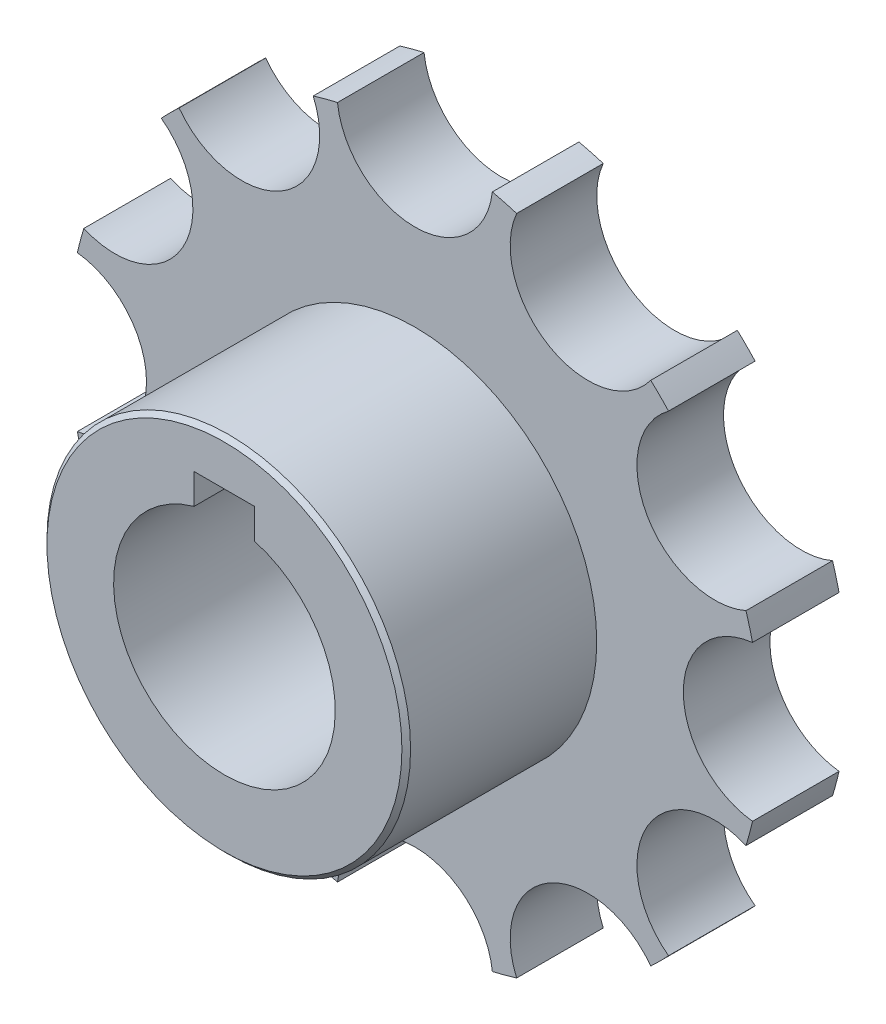
ISO-10303-21;
HEADER;
FILE_DESCRIPTION(('STEP AP214'),'2;1');
FILE_NAME('part.step','',(''),(''),'','','');
FILE_SCHEMA(('AUTOMOTIVE_DESIGN { 1 0 10303 214 1 1 1 1 }'));
ENDSEC;
DATA;
#1=APPLICATION_CONTEXT('core data for automotive mechanical design processes');
#2=APPLICATION_PROTOCOL_DEFINITION('international standard','automotive_design',2000,#1);
#3=PRODUCT_CONTEXT('',#1,'mechanical');
#4=PRODUCT('Part','Part','',(#3));
#5=PRODUCT_RELATED_PRODUCT_CATEGORY('part','',(#4));
#6=PRODUCT_DEFINITION_FORMATION('','',#4);
#7=PRODUCT_DEFINITION_CONTEXT('part definition',#1,'design');
#8=PRODUCT_DEFINITION('design','',#6,#7);
#9=PRODUCT_DEFINITION_SHAPE('','',#8);
#10=(LENGTH_UNIT() NAMED_UNIT(*) SI_UNIT(.MILLI.,.METRE.));
#11=(NAMED_UNIT(*) PLANE_ANGLE_UNIT() SI_UNIT($,.RADIAN.));
#12=(NAMED_UNIT(*) SI_UNIT($,.STERADIAN.) SOLID_ANGLE_UNIT());
#13=UNCERTAINTY_MEASURE_WITH_UNIT(LENGTH_MEASURE(1.E-05),#10,'distance_accuracy_value','');
#14=(GEOMETRIC_REPRESENTATION_CONTEXT(3) GLOBAL_UNCERTAINTY_ASSIGNED_CONTEXT((#13)) GLOBAL_UNIT_ASSIGNED_CONTEXT((#10,
#11,#12)) REPRESENTATION_CONTEXT('',''));
#15=CARTESIAN_POINT('',(0.,0.,0.));
#16=DIRECTION('',(0.,0.,1.));
#17=DIRECTION('',(1.,0.,0.));
#18=AXIS2_PLACEMENT_3D('',#15,#16,#17);
#19=CARTESIAN_POINT('',(-19.9999999999996,34.6410161513778,10.));
#20=DIRECTION('',(0.,0.,-1.));
#21=DIRECTION('',(-1.,0.,0.));
#22=AXIS2_PLACEMENT_3D('',#19,#20,#21);
#23=CYLINDRICAL_SURFACE('',#22,8.99999999999999);
#24=CARTESIAN_POINT('',(-19.9999999999996,34.6410161513778,0.));
#25=DIRECTION('',(0.,0.,1.));
#26=DIRECTION('',(1.,0.,0.));
#27=AXIS2_PLACEMENT_3D('',#24,#25,#26);
#28=CIRCLE('',#27,8.99999999999999);
#29=CARTESIAN_POINT('',(-27.2384987249422,29.2927326688945,0.));
#30=VERTEX_POINT('',#29);
#31=CARTESIAN_POINT('',(-11.7490012750569,38.2355981911976,0.));
#32=VERTEX_POINT('',#31);
#33=EDGE_CURVE('E279',#30,#32,#28,.T.);
#34=ORIENTED_EDGE('',*,*,#33,.F.);
#35=DIRECTION('',(0.,0.,-1.));
#36=VECTOR('',#35,1.);
#37=CARTESIAN_POINT('',(-27.2384987249422,29.2927326688945,10.));
#38=LINE('',#37,#36);
#39=CARTESIAN_POINT('',(-27.2384987249422,29.2927326688945,10.));
#40=VERTEX_POINT('',#39);
#41=EDGE_CURVE('E165',#40,#30,#38,.T.);
#42=ORIENTED_EDGE('',*,*,#41,.F.);
#43=CARTESIAN_POINT('',(-19.9999999999996,34.6410161513778,10.));
#44=DIRECTION('',(0.,0.,1.));
#45=DIRECTION('',(1.,0.,0.));
#46=AXIS2_PLACEMENT_3D('',#43,#44,#45);
#47=CIRCLE('',#46,8.99999999999999);
#48=CARTESIAN_POINT('',(-11.7490012750569,38.2355981911976,10.));
#49=VERTEX_POINT('',#48);
#50=EDGE_CURVE('E496',#40,#49,#47,.T.);
#51=ORIENTED_EDGE('',*,*,#50,.T.);
#52=DIRECTION('',(0.,0.,-1.));
#53=VECTOR('',#52,1.);
#54=CARTESIAN_POINT('',(-11.7490012750569,38.2355981911976,10.));
#55=LINE('',#54,#53);
#56=EDGE_CURVE('E160',#49,#32,#55,.T.);
#57=ORIENTED_EDGE('',*,*,#56,.T.);
#58=EDGE_LOOP('',(#34,#42,#51,#57));
#59=FACE_BOUND('',#58,.T.);
#60=ADVANCED_FACE('F41',(#59),#23,.F.);
#61=CARTESIAN_POINT('',(0.,0.,10.));
#62=DIRECTION('',(0.,0.,-1.));
#63=DIRECTION('',(-1.,0.,0.));
#64=AXIS2_PLACEMENT_3D('',#61,#62,#63);
#65=CYLINDRICAL_SURFACE('',#64,40.);
#66=CARTESIAN_POINT('',(0.,0.,0.));
#67=DIRECTION('',(0.,0.,1.));
#68=DIRECTION('',(1.,0.,0.));
#69=AXIS2_PLACEMENT_3D('',#66,#67,#68);
#70=CIRCLE('',#69,40.);
#71=CARTESIAN_POINT('',(-29.2927326688938,27.238498724943,0.));
#72=VERTEX_POINT('',#71);
#73=EDGE_CURVE('E283',#30,#72,#70,.T.);
#74=ORIENTED_EDGE('',*,*,#73,.T.);
#75=DIRECTION('',(0.,0.,-1.));
#76=VECTOR('',#75,1.);
#77=CARTESIAN_POINT('',(-29.2927326688938,27.238498724943,10.));
#78=LINE('',#77,#76);
#79=CARTESIAN_POINT('',(-29.2927326688938,27.238498724943,10.));
#80=VERTEX_POINT('',#79);
#81=EDGE_CURVE('E400',#80,#72,#78,.T.);
#82=ORIENTED_EDGE('',*,*,#81,.F.);
#83=CARTESIAN_POINT('',(0.,0.,10.));
#84=DIRECTION('',(0.,0.,1.));
#85=DIRECTION('',(1.,0.,0.));
#86=AXIS2_PLACEMENT_3D('',#83,#84,#85);
#87=CIRCLE('',#86,40.);
#88=EDGE_CURVE('E259',#40,#80,#87,.T.);
#89=ORIENTED_EDGE('',*,*,#88,.F.);
#90=ORIENTED_EDGE('',*,*,#41,.T.);
#91=EDGE_LOOP('',(#74,#82,#89,#90));
#92=FACE_BOUND('',#91,.T.);
#93=ADVANCED_FACE('F432',(#92),#65,.T.);
#94=CARTESIAN_POINT('',(-34.6410161513773,20.0000000000004,10.));
#95=DIRECTION('',(0.,0.,-1.));
#96=DIRECTION('',(-1.,0.,0.));
#97=AXIS2_PLACEMENT_3D('',#94,#95,#96);
#98=CYLINDRICAL_SURFACE('',#97,9.);
#99=CARTESIAN_POINT('',(-34.6410161513773,20.0000000000004,0.));
#100=DIRECTION('',(0.,0.,1.));
#101=DIRECTION('',(1.,0.,0.));
#102=AXIS2_PLACEMENT_3D('',#99,#100,#101);
#103=CIRCLE('',#102,9.);
#104=CARTESIAN_POINT('',(-38.2355981911973,11.7490012750578,0.));
#105=VERTEX_POINT('',#104);
#106=EDGE_CURVE('E287',#105,#72,#103,.T.);
#107=ORIENTED_EDGE('',*,*,#106,.F.);
#108=DIRECTION('',(0.,0.,-1.));
#109=VECTOR('',#108,1.);
#110=CARTESIAN_POINT('',(-38.2355981911973,11.7490012750578,10.));
#111=LINE('',#110,#109);
#112=CARTESIAN_POINT('',(-38.2355981911973,11.7490012750578,10.));
#113=VERTEX_POINT('',#112);
#114=EDGE_CURVE('E397',#113,#105,#111,.T.);
#115=ORIENTED_EDGE('',*,*,#114,.F.);
#116=CARTESIAN_POINT('',(-34.6410161513773,20.0000000000004,10.));
#117=DIRECTION('',(0.,0.,1.));
#118=DIRECTION('',(1.,0.,0.));
#119=AXIS2_PLACEMENT_3D('',#116,#117,#118);
#120=CIRCLE('',#119,9.);
#121=EDGE_CURVE('E500',#113,#80,#120,.T.);
#122=ORIENTED_EDGE('',*,*,#121,.T.);
#123=ORIENTED_EDGE('',*,*,#81,.T.);
#124=EDGE_LOOP('',(#107,#115,#122,#123));
#125=FACE_BOUND('',#124,.T.);
#126=ADVANCED_FACE('F437',(#125),#98,.F.);
#127=CARTESIAN_POINT('',(-38.9874999999999,8.94286552230365,0.));
#128=VERTEX_POINT('',#127);
#129=EDGE_CURVE('E289',#105,#128,#70,.T.);
#130=ORIENTED_EDGE('',*,*,#129,.T.);
#131=DIRECTION('',(0.,0.,-1.));
#132=VECTOR('',#131,1.);
#133=CARTESIAN_POINT('',(-38.9874999999999,8.94286552230365,10.));
#134=LINE('',#133,#132);
#135=CARTESIAN_POINT('',(-38.9874999999999,8.94286552230365,10.));
#136=VERTEX_POINT('',#135);
#137=EDGE_CURVE('E394',#136,#128,#134,.T.);
#138=ORIENTED_EDGE('',*,*,#137,.F.);
#139=EDGE_CURVE('E501',#113,#136,#87,.T.);
#140=ORIENTED_EDGE('',*,*,#139,.F.);
#141=ORIENTED_EDGE('',*,*,#114,.T.);
#142=EDGE_LOOP('',(#130,#138,#140,#141));
#143=FACE_BOUND('',#142,.T.);
#144=ADVANCED_FACE('F440',(#143),#65,.T.);
#145=CARTESIAN_POINT('',(-40.,4.18977760661176E-13,10.));
#146=DIRECTION('',(0.,0.,-1.));
#147=DIRECTION('',(-1.,0.,0.));
#148=AXIS2_PLACEMENT_3D('',#145,#146,#147);
#149=CYLINDRICAL_SURFACE('',#148,9.);
#150=CARTESIAN_POINT('',(-40.,4.18977760661176E-13,0.));
#151=DIRECTION('',(0.,0.,1.));
#152=DIRECTION('',(1.,0.,0.));
#153=AXIS2_PLACEMENT_3D('',#150,#151,#152);
#154=CIRCLE('',#153,9.);
#155=CARTESIAN_POINT('',(-38.9875000000001,-8.94286552230283,0.));
#156=VERTEX_POINT('',#155);
#157=EDGE_CURVE('E293',#156,#128,#154,.T.);
#158=ORIENTED_EDGE('',*,*,#157,.F.);
#159=DIRECTION('',(0.,0.,-1.));
#160=VECTOR('',#159,1.);
#161=CARTESIAN_POINT('',(-38.9875000000001,-8.94286552230283,10.));
#162=LINE('',#161,#160);
#163=CARTESIAN_POINT('',(-38.9875000000001,-8.94286552230283,10.));
#164=VERTEX_POINT('',#163);
#165=EDGE_CURVE('E391',#164,#156,#162,.T.);
#166=ORIENTED_EDGE('',*,*,#165,.F.);
#167=CARTESIAN_POINT('',(-40.,4.18977760661176E-13,10.));
#168=DIRECTION('',(0.,0.,1.));
#169=DIRECTION('',(1.,0.,0.));
#170=AXIS2_PLACEMENT_3D('',#167,#168,#169);
#171=CIRCLE('',#170,9.);
#172=EDGE_CURVE('E505',#164,#136,#171,.T.);
#173=ORIENTED_EDGE('',*,*,#172,.T.);
#174=ORIENTED_EDGE('',*,*,#137,.T.);
#175=EDGE_LOOP('',(#158,#166,#173,#174));
#176=FACE_BOUND('',#175,.T.);
#177=ADVANCED_FACE('F582',(#176),#149,.F.);
#178=CARTESIAN_POINT('',(-38.2355981911975,-11.7490012750571,0.));
#179=VERTEX_POINT('',#178);
#180=EDGE_CURVE('E297',#156,#179,#70,.T.);
#181=ORIENTED_EDGE('',*,*,#180,.T.);
#182=DIRECTION('',(0.,0.,-1.));
#183=VECTOR('',#182,1.);
#184=CARTESIAN_POINT('',(-38.2355981911975,-11.7490012750571,10.));
#185=LINE('',#184,#183);
#186=CARTESIAN_POINT('',(-38.2355981911975,-11.7490012750571,10.));
#187=VERTEX_POINT('',#186);
#188=EDGE_CURVE('E388',#187,#179,#185,.T.);
#189=ORIENTED_EDGE('',*,*,#188,.F.);
#190=EDGE_CURVE('E509',#164,#187,#87,.T.);
#191=ORIENTED_EDGE('',*,*,#190,.F.);
#192=ORIENTED_EDGE('',*,*,#165,.T.);
#193=EDGE_LOOP('',(#181,#189,#191,#192));
#194=FACE_BOUND('',#193,.T.);
#195=ADVANCED_FACE('F586',(#194),#65,.T.);
#196=CARTESIAN_POINT('',(-34.6410161513777,-19.9999999999997,10.));
#197=DIRECTION('',(0.,0.,-1.));
#198=DIRECTION('',(-1.,0.,0.));
#199=AXIS2_PLACEMENT_3D('',#196,#197,#198);
#200=CYLINDRICAL_SURFACE('',#199,8.99999999999999);
#201=CARTESIAN_POINT('',(-34.6410161513777,-19.9999999999997,0.));
#202=DIRECTION('',(0.,0.,1.));
#203=DIRECTION('',(1.,0.,0.));
#204=AXIS2_PLACEMENT_3D('',#201,#202,#203);
#205=CIRCLE('',#204,8.99999999999999);
#206=CARTESIAN_POINT('',(-29.2927326688944,-27.2384987249423,0.));
#207=VERTEX_POINT('',#206);
#208=EDGE_CURVE('E298',#207,#179,#205,.T.);
#209=ORIENTED_EDGE('',*,*,#208,.F.);
#210=DIRECTION('',(0.,0.,-1.));
#211=VECTOR('',#210,1.);
#212=CARTESIAN_POINT('',(-29.2927326688944,-27.2384987249423,10.));
#213=LINE('',#212,#211);
#214=CARTESIAN_POINT('',(-29.2927326688944,-27.2384987249423,10.));
#215=VERTEX_POINT('',#214);
#216=EDGE_CURVE('E385',#215,#207,#213,.T.);
#217=ORIENTED_EDGE('',*,*,#216,.F.);
#218=CARTESIAN_POINT('',(-34.6410161513777,-19.9999999999997,10.));
#219=DIRECTION('',(0.,0.,1.));
#220=DIRECTION('',(1.,0.,0.));
#221=AXIS2_PLACEMENT_3D('',#218,#219,#220);
#222=CIRCLE('',#221,8.99999999999999);
#223=EDGE_CURVE('E510',#215,#187,#222,.T.);
#224=ORIENTED_EDGE('',*,*,#223,.T.);
#225=ORIENTED_EDGE('',*,*,#188,.T.);
#226=EDGE_LOOP('',(#209,#217,#224,#225));
#227=FACE_BOUND('',#226,.T.);
#228=ADVANCED_FACE('F589',(#227),#200,.F.);
#229=CARTESIAN_POINT('',(-27.2384987249429,-29.2927326688939,0.));
#230=VERTEX_POINT('',#229);
#231=EDGE_CURVE('E302',#207,#230,#70,.T.);
#232=ORIENTED_EDGE('',*,*,#231,.T.);
#233=DIRECTION('',(0.,0.,-1.));
#234=VECTOR('',#233,1.);
#235=CARTESIAN_POINT('',(-27.2384987249429,-29.2927326688939,10.));
#236=LINE('',#235,#234);
#237=CARTESIAN_POINT('',(-27.2384987249429,-29.2927326688939,10.));
#238=VERTEX_POINT('',#237);
#239=EDGE_CURVE('E382',#238,#230,#236,.T.);
#240=ORIENTED_EDGE('',*,*,#239,.F.);
#241=EDGE_CURVE('E514',#215,#238,#87,.T.);
#242=ORIENTED_EDGE('',*,*,#241,.F.);
#243=ORIENTED_EDGE('',*,*,#216,.T.);
#244=EDGE_LOOP('',(#232,#240,#242,#243));
#245=FACE_BOUND('',#244,.T.);
#246=ADVANCED_FACE('F593',(#245),#65,.T.);
#247=CARTESIAN_POINT('',(-19.9999999999989,-34.6410161513778,10.));
#248=DIRECTION('',(0.,0.,-1.));
#249=DIRECTION('',(-1.,0.,0.));
#250=AXIS2_PLACEMENT_3D('',#247,#248,#249);
#251=CYLINDRICAL_SURFACE('',#250,9.00000000000139);
#252=CARTESIAN_POINT('',(-19.9999999999989,-34.6410161513778,0.));
#253=DIRECTION('',(0.,0.,1.));
#254=DIRECTION('',(1.,0.,0.));
#255=AXIS2_PLACEMENT_3D('',#252,#253,#254);
#256=CIRCLE('',#255,9.00000000000139);
#257=CARTESIAN_POINT('',(-11.749001275055,-38.2355981911981,0.));
#258=VERTEX_POINT('',#257);
#259=EDGE_CURVE('E303',#258,#230,#256,.T.);
#260=ORIENTED_EDGE('',*,*,#259,.F.);
#261=DIRECTION('',(0.,0.,-1.));
#262=VECTOR('',#261,1.);
#263=CARTESIAN_POINT('',(-11.749001275055,-38.2355981911981,10.));
#264=LINE('',#263,#262);
#265=CARTESIAN_POINT('',(-11.749001275055,-38.2355981911981,10.));
#266=VERTEX_POINT('',#265);
#267=EDGE_CURVE('E379',#266,#258,#264,.T.);
#268=ORIENTED_EDGE('',*,*,#267,.F.);
#269=CARTESIAN_POINT('',(-19.9999999999989,-34.6410161513778,10.));
#270=DIRECTION('',(0.,0.,1.));
#271=DIRECTION('',(1.,0.,0.));
#272=AXIS2_PLACEMENT_3D('',#269,#270,#271);
#273=CIRCLE('',#272,9.00000000000139);
#274=EDGE_CURVE('E515',#266,#238,#273,.T.);
#275=ORIENTED_EDGE('',*,*,#274,.T.);
#276=ORIENTED_EDGE('',*,*,#239,.T.);
#277=EDGE_LOOP('',(#260,#268,#275,#276));
#278=FACE_BOUND('',#277,.T.);
#279=ADVANCED_FACE('F596',(#278),#251,.F.);
#280=CARTESIAN_POINT('',(-8.94286552230344,-38.9875,0.));
#281=VERTEX_POINT('',#280);
#282=EDGE_CURVE('E307',#258,#281,#70,.T.);
#283=ORIENTED_EDGE('',*,*,#282,.T.);
#284=DIRECTION('',(0.,0.,-1.));
#285=VECTOR('',#284,1.);
#286=CARTESIAN_POINT('',(-8.94286552230344,-38.9875,10.));
#287=LINE('',#286,#285);
#288=CARTESIAN_POINT('',(-8.94286552230344,-38.9875,10.));
#289=VERTEX_POINT('',#288);
#290=EDGE_CURVE('E376',#289,#281,#287,.T.);
#291=ORIENTED_EDGE('',*,*,#290,.F.);
#292=EDGE_CURVE('E519',#266,#289,#87,.T.);
#293=ORIENTED_EDGE('',*,*,#292,.F.);
#294=ORIENTED_EDGE('',*,*,#267,.T.);
#295=EDGE_LOOP('',(#283,#291,#293,#294));
#296=FACE_BOUND('',#295,.T.);
#297=ADVANCED_FACE('F600',(#296),#65,.T.);
#298=CARTESIAN_POINT('',(1.12217261562639E-12,-40.,10.));
#299=DIRECTION('',(0.,0.,-1.));
#300=DIRECTION('',(-1.,0.,0.));
#301=AXIS2_PLACEMENT_3D('',#298,#299,#300);
#302=CYLINDRICAL_SURFACE('',#301,9.00000000000134);
#303=CARTESIAN_POINT('',(1.12217261562639E-12,-40.,0.));
#304=DIRECTION('',(0.,0.,1.));
#305=DIRECTION('',(1.,0.,0.));
#306=AXIS2_PLACEMENT_3D('',#303,#304,#305);
#307=CIRCLE('',#306,9.00000000000134);
#308=CARTESIAN_POINT('',(8.94286552230563,-38.9874999999995,0.));
#309=VERTEX_POINT('',#308);
#310=EDGE_CURVE('E308',#309,#281,#307,.T.);
#311=ORIENTED_EDGE('',*,*,#310,.F.);
#312=DIRECTION('',(0.,0.,-1.));
#313=VECTOR('',#312,1.);
#314=CARTESIAN_POINT('',(8.94286552230563,-38.9874999999995,10.));
#315=LINE('',#314,#313);
#316=CARTESIAN_POINT('',(8.94286552230563,-38.9874999999995,10.));
#317=VERTEX_POINT('',#316);
#318=EDGE_CURVE('E373',#317,#309,#315,.T.);
#319=ORIENTED_EDGE('',*,*,#318,.F.);
#320=CARTESIAN_POINT('',(1.12217261562639E-12,-40.,10.));
#321=DIRECTION('',(0.,0.,1.));
#322=DIRECTION('',(1.,0.,0.));
#323=AXIS2_PLACEMENT_3D('',#320,#321,#322);
#324=CIRCLE('',#323,9.00000000000134);
#325=EDGE_CURVE('E520',#317,#289,#324,.T.);
#326=ORIENTED_EDGE('',*,*,#325,.T.);
#327=ORIENTED_EDGE('',*,*,#290,.T.);
#328=EDGE_LOOP('',(#311,#319,#326,#327));
#329=FACE_BOUND('',#328,.T.);
#330=ADVANCED_FACE('F603',(#329),#302,.F.);
#331=CARTESIAN_POINT('',(11.7490012750572,-38.2355981911975,0.));
#332=VERTEX_POINT('',#331);
#333=EDGE_CURVE('E312',#309,#332,#70,.T.);
#334=ORIENTED_EDGE('',*,*,#333,.T.);
#335=DIRECTION('',(0.,0.,-1.));
#336=VECTOR('',#335,1.);
#337=CARTESIAN_POINT('',(11.7490012750572,-38.2355981911975,10.));
#338=LINE('',#337,#336);
#339=CARTESIAN_POINT('',(11.7490012750572,-38.2355981911975,10.));
#340=VERTEX_POINT('',#339);
#341=EDGE_CURVE('E370',#340,#332,#338,.T.);
#342=ORIENTED_EDGE('',*,*,#341,.F.);
#343=EDGE_CURVE('E524',#317,#340,#87,.T.);
#344=ORIENTED_EDGE('',*,*,#343,.F.);
#345=ORIENTED_EDGE('',*,*,#318,.T.);
#346=EDGE_LOOP('',(#334,#342,#344,#345));
#347=FACE_BOUND('',#346,.T.);
#348=ADVANCED_FACE('F607',(#347),#65,.T.);
#349=CARTESIAN_POINT('',(19.9999999999998,-34.6410161513777,10.));
#350=DIRECTION('',(0.,0.,-1.));
#351=DIRECTION('',(-1.,0.,0.));
#352=AXIS2_PLACEMENT_3D('',#349,#350,#351);
#353=CYLINDRICAL_SURFACE('',#352,9.);
#354=CARTESIAN_POINT('',(19.9999999999998,-34.6410161513777,0.));
#355=DIRECTION('',(0.,0.,1.));
#356=DIRECTION('',(1.,0.,0.));
#357=AXIS2_PLACEMENT_3D('',#354,#355,#356);
#358=CIRCLE('',#357,9.);
#359=CARTESIAN_POINT('',(27.2384987249424,-29.2927326688943,0.));
#360=VERTEX_POINT('',#359);
#361=EDGE_CURVE('E313',#360,#332,#358,.T.);
#362=ORIENTED_EDGE('',*,*,#361,.F.);
#363=DIRECTION('',(0.,0.,-1.));
#364=VECTOR('',#363,1.);
#365=CARTESIAN_POINT('',(27.2384987249424,-29.2927326688943,10.));
#366=LINE('',#365,#364);
#367=CARTESIAN_POINT('',(27.2384987249424,-29.2927326688943,10.));
#368=VERTEX_POINT('',#367);
#369=EDGE_CURVE('E367',#368,#360,#366,.T.);
#370=ORIENTED_EDGE('',*,*,#369,.F.);
#371=CARTESIAN_POINT('',(19.9999999999998,-34.6410161513777,10.));
#372=DIRECTION('',(0.,0.,1.));
#373=DIRECTION('',(1.,0.,0.));
#374=AXIS2_PLACEMENT_3D('',#371,#372,#373);
#375=CIRCLE('',#374,9.);
#376=EDGE_CURVE('E525',#368,#340,#375,.T.);
#377=ORIENTED_EDGE('',*,*,#376,.T.);
#378=ORIENTED_EDGE('',*,*,#341,.T.);
#379=EDGE_LOOP('',(#362,#370,#377,#378));
#380=FACE_BOUND('',#379,.T.);
#381=ADVANCED_FACE('F610',(#380),#353,.F.);
#382=CARTESIAN_POINT('',(29.292732668894,-27.2384987249428,0.));
#383=VERTEX_POINT('',#382);
#384=EDGE_CURVE('E317',#360,#383,#70,.T.);
#385=ORIENTED_EDGE('',*,*,#384,.T.);
#386=DIRECTION('',(0.,0.,-1.));
#387=VECTOR('',#386,1.);
#388=CARTESIAN_POINT('',(29.292732668894,-27.2384987249428,10.));
#389=LINE('',#388,#387);
#390=CARTESIAN_POINT('',(29.292732668894,-27.2384987249428,10.));
#391=VERTEX_POINT('',#390);
#392=EDGE_CURVE('E364',#391,#383,#389,.T.);
#393=ORIENTED_EDGE('',*,*,#392,.F.);
#394=EDGE_CURVE('E529',#368,#391,#87,.T.);
#395=ORIENTED_EDGE('',*,*,#394,.F.);
#396=ORIENTED_EDGE('',*,*,#369,.T.);
#397=EDGE_LOOP('',(#385,#393,#395,#396));
#398=FACE_BOUND('',#397,.T.);
#399=ADVANCED_FACE('F614',(#398),#65,.T.);
#400=CARTESIAN_POINT('',(34.6410161513775,-20.0000000000002,10.));
#401=DIRECTION('',(0.,0.,-1.));
#402=DIRECTION('',(-1.,0.,0.));
#403=AXIS2_PLACEMENT_3D('',#400,#401,#402);
#404=CYLINDRICAL_SURFACE('',#403,9.);
#405=CARTESIAN_POINT('',(34.6410161513775,-20.0000000000002,0.));
#406=DIRECTION('',(0.,0.,1.));
#407=DIRECTION('',(1.,0.,0.));
#408=AXIS2_PLACEMENT_3D('',#405,#406,#407);
#409=CIRCLE('',#408,9.);
#410=CARTESIAN_POINT('',(38.2355981911974,-11.7490012750576,0.));
#411=VERTEX_POINT('',#410);
#412=EDGE_CURVE('E318',#411,#383,#409,.T.);
#413=ORIENTED_EDGE('',*,*,#412,.F.);
#414=DIRECTION('',(0.,0.,-1.));
#415=VECTOR('',#414,1.);
#416=CARTESIAN_POINT('',(38.2355981911974,-11.7490012750576,10.));
#417=LINE('',#416,#415);
#418=CARTESIAN_POINT('',(38.2355981911974,-11.7490012750576,10.));
#419=VERTEX_POINT('',#418);
#420=EDGE_CURVE('E361',#419,#411,#417,.T.);
#421=ORIENTED_EDGE('',*,*,#420,.F.);
#422=CARTESIAN_POINT('',(34.6410161513775,-20.0000000000002,10.));
#423=DIRECTION('',(0.,0.,1.));
#424=DIRECTION('',(1.,0.,0.));
#425=AXIS2_PLACEMENT_3D('',#422,#423,#424);
#426=CIRCLE('',#425,9.);
#427=EDGE_CURVE('E530',#419,#391,#426,.T.);
#428=ORIENTED_EDGE('',*,*,#427,.T.);
#429=ORIENTED_EDGE('',*,*,#392,.T.);
#430=EDGE_LOOP('',(#413,#421,#428,#429));
#431=FACE_BOUND('',#430,.T.);
#432=ADVANCED_FACE('F617',(#431),#404,.F.);
#433=CARTESIAN_POINT('',(38.9875,-8.94286552230338,0.));
#434=VERTEX_POINT('',#433);
#435=EDGE_CURVE('E322',#411,#434,#70,.T.);
#436=ORIENTED_EDGE('',*,*,#435,.T.);
#437=DIRECTION('',(0.,0.,-1.));
#438=VECTOR('',#437,1.);
#439=CARTESIAN_POINT('',(38.9875,-8.94286552230338,10.));
#440=LINE('',#439,#438);
#441=CARTESIAN_POINT('',(38.9875,-8.94286552230338,10.));
#442=VERTEX_POINT('',#441);
#443=EDGE_CURVE('E358',#442,#434,#440,.T.);
#444=ORIENTED_EDGE('',*,*,#443,.F.);
#445=EDGE_CURVE('E534',#419,#442,#87,.T.);
#446=ORIENTED_EDGE('',*,*,#445,.F.);
#447=ORIENTED_EDGE('',*,*,#420,.T.);
#448=EDGE_LOOP('',(#436,#444,#446,#447));
#449=FACE_BOUND('',#448,.T.);
#450=ADVANCED_FACE('F621',(#449),#65,.T.);
#451=CARTESIAN_POINT('',(40.,-1.39659253553725E-13,10.));
#452=DIRECTION('',(0.,0.,-1.));
#453=DIRECTION('',(-1.,0.,0.));
#454=AXIS2_PLACEMENT_3D('',#451,#452,#453);
#455=CYLINDRICAL_SURFACE('',#454,9.);
#456=CARTESIAN_POINT('',(40.,-1.39659253553725E-13,0.));
#457=DIRECTION('',(0.,0.,1.));
#458=DIRECTION('',(1.,0.,0.));
#459=AXIS2_PLACEMENT_3D('',#456,#457,#458);
#460=CIRCLE('',#459,9.);
#461=CARTESIAN_POINT('',(38.9875,8.94286552230311,0.));
#462=VERTEX_POINT('',#461);
#463=EDGE_CURVE('E323',#462,#434,#460,.T.);
#464=ORIENTED_EDGE('',*,*,#463,.F.);
#465=DIRECTION('',(0.,0.,-1.));
#466=VECTOR('',#465,1.);
#467=CARTESIAN_POINT('',(38.9875,8.94286552230311,10.));
#468=LINE('',#467,#466);
#469=CARTESIAN_POINT('',(38.9875,8.94286552230311,10.));
#470=VERTEX_POINT('',#469);
#471=EDGE_CURVE('E355',#470,#462,#468,.T.);
#472=ORIENTED_EDGE('',*,*,#471,.F.);
#473=CARTESIAN_POINT('',(40.,-1.39659253553725E-13,10.));
#474=DIRECTION('',(0.,0.,1.));
#475=DIRECTION('',(1.,0.,0.));
#476=AXIS2_PLACEMENT_3D('',#473,#474,#475);
#477=CIRCLE('',#476,9.);
#478=EDGE_CURVE('E535',#470,#442,#477,.T.);
#479=ORIENTED_EDGE('',*,*,#478,.T.);
#480=ORIENTED_EDGE('',*,*,#443,.T.);
#481=EDGE_LOOP('',(#464,#472,#479,#480));
#482=FACE_BOUND('',#481,.T.);
#483=ADVANCED_FACE('F624',(#482),#455,.F.);
#484=CARTESIAN_POINT('',(38.2355981911975,11.7490012750573,0.));
#485=VERTEX_POINT('',#484);
#486=EDGE_CURVE('E327',#462,#485,#70,.T.);
#487=ORIENTED_EDGE('',*,*,#486,.T.);
#488=DIRECTION('',(0.,0.,-1.));
#489=VECTOR('',#488,1.);
#490=CARTESIAN_POINT('',(38.2355981911975,11.7490012750573,10.));
#491=LINE('',#490,#489);
#492=CARTESIAN_POINT('',(38.2355981911975,11.7490012750573,10.));
#493=VERTEX_POINT('',#492);
#494=EDGE_CURVE('E352',#493,#485,#491,.T.);
#495=ORIENTED_EDGE('',*,*,#494,.F.);
#496=EDGE_CURVE('E538',#470,#493,#87,.T.);
#497=ORIENTED_EDGE('',*,*,#496,.F.);
#498=ORIENTED_EDGE('',*,*,#471,.T.);
#499=EDGE_LOOP('',(#487,#495,#497,#498));
#500=FACE_BOUND('',#499,.T.);
#501=ADVANCED_FACE('F628',(#500),#65,.T.);
#502=CARTESIAN_POINT('',(34.6410161513776,19.9999999999999,10.));
#503=DIRECTION('',(0.,0.,-1.));
#504=DIRECTION('',(-1.,0.,0.));
#505=AXIS2_PLACEMENT_3D('',#502,#503,#504);
#506=CYLINDRICAL_SURFACE('',#505,9.);
#507=CARTESIAN_POINT('',(34.6410161513776,19.9999999999999,0.));
#508=DIRECTION('',(0.,0.,1.));
#509=DIRECTION('',(1.,0.,0.));
#510=AXIS2_PLACEMENT_3D('',#507,#508,#509);
#511=CIRCLE('',#510,9.);
#512=CARTESIAN_POINT('',(29.2927326688942,27.2384987249426,0.));
#513=VERTEX_POINT('',#512);
#514=EDGE_CURVE('E328',#513,#485,#511,.T.);
#515=ORIENTED_EDGE('',*,*,#514,.F.);
#516=DIRECTION('',(0.,0.,-1.));
#517=VECTOR('',#516,1.);
#518=CARTESIAN_POINT('',(29.2927326688942,27.2384987249426,10.));
#519=LINE('',#518,#517);
#520=CARTESIAN_POINT('',(29.2927326688942,27.2384987249426,10.));
#521=VERTEX_POINT('',#520);
#522=EDGE_CURVE('E349',#521,#513,#519,.T.);
#523=ORIENTED_EDGE('',*,*,#522,.F.);
#524=CARTESIAN_POINT('',(34.6410161513776,19.9999999999999,10.));
#525=DIRECTION('',(0.,0.,1.));
#526=DIRECTION('',(1.,0.,0.));
#527=AXIS2_PLACEMENT_3D('',#524,#525,#526);
#528=CIRCLE('',#527,9.);
#529=EDGE_CURVE('E539',#521,#493,#528,.T.);
#530=ORIENTED_EDGE('',*,*,#529,.T.);
#531=ORIENTED_EDGE('',*,*,#494,.T.);
#532=EDGE_LOOP('',(#515,#523,#530,#531));
#533=FACE_BOUND('',#532,.T.);
#534=ADVANCED_FACE('F630',(#533),#506,.F.);
#535=CARTESIAN_POINT('',(27.2384987249426,29.2927326688941,0.));
#536=VERTEX_POINT('',#535);
#537=EDGE_CURVE('E332',#513,#536,#70,.T.);
#538=ORIENTED_EDGE('',*,*,#537,.T.);
#539=DIRECTION('',(0.,0.,-1.));
#540=VECTOR('',#539,1.);
#541=CARTESIAN_POINT('',(27.2384987249426,29.2927326688941,10.));
#542=LINE('',#541,#540);
#543=CARTESIAN_POINT('',(27.2384987249426,29.2927326688941,10.));
#544=VERTEX_POINT('',#543);
#545=EDGE_CURVE('E346',#544,#536,#542,.T.);
#546=ORIENTED_EDGE('',*,*,#545,.F.);
#547=EDGE_CURVE('E241',#521,#544,#87,.T.);
#548=ORIENTED_EDGE('',*,*,#547,.F.);
#549=ORIENTED_EDGE('',*,*,#522,.T.);
#550=EDGE_LOOP('',(#538,#546,#548,#549));
#551=FACE_BOUND('',#550,.T.);
#552=ADVANCED_FACE('F693',(#551),#65,.T.);
#553=CARTESIAN_POINT('',(20.,34.6410161513775,10.));
#554=DIRECTION('',(0.,0.,-1.));
#555=DIRECTION('',(-1.,0.,0.));
#556=AXIS2_PLACEMENT_3D('',#553,#554,#555);
#557=CYLINDRICAL_SURFACE('',#556,8.99999999999999);
#558=CARTESIAN_POINT('',(20.,34.6410161513775,0.));
#559=DIRECTION('',(0.,0.,1.));
#560=DIRECTION('',(1.,0.,0.));
#561=AXIS2_PLACEMENT_3D('',#558,#559,#560);
#562=CIRCLE('',#561,8.99999999999999);
#563=CARTESIAN_POINT('',(11.7490012750574,38.2355981911974,0.));
#564=VERTEX_POINT('',#563);
#565=EDGE_CURVE('E333',#564,#536,#562,.T.);
#566=ORIENTED_EDGE('',*,*,#565,.F.);
#567=DIRECTION('',(0.,0.,-1.));
#568=VECTOR('',#567,1.);
#569=CARTESIAN_POINT('',(11.7490012750574,38.2355981911974,10.));
#570=LINE('',#569,#568);
#571=CARTESIAN_POINT('',(11.7490012750574,38.2355981911974,10.));
#572=VERTEX_POINT('',#571);
#573=EDGE_CURVE('E251',#572,#564,#570,.T.);
#574=ORIENTED_EDGE('',*,*,#573,.F.);
#575=CARTESIAN_POINT('',(20.,34.6410161513775,10.));
#576=DIRECTION('',(0.,0.,1.));
#577=DIRECTION('',(1.,0.,0.));
#578=AXIS2_PLACEMENT_3D('',#575,#576,#577);
#579=CIRCLE('',#578,8.99999999999999);
#580=EDGE_CURVE('E237',#572,#544,#579,.T.);
#581=ORIENTED_EDGE('',*,*,#580,.T.);
#582=ORIENTED_EDGE('',*,*,#545,.T.);
#583=EDGE_LOOP('',(#566,#574,#581,#582));
#584=FACE_BOUND('',#583,.T.);
#585=ADVANCED_FACE('F699',(#584),#557,.F.);
#586=CARTESIAN_POINT('',(8.94286552230324,38.9875,0.));
#587=VERTEX_POINT('',#586);
#588=EDGE_CURVE('E246',#564,#587,#70,.T.);
#589=ORIENTED_EDGE('',*,*,#588,.T.);
#590=DIRECTION('',(0.,0.,-1.));
#591=VECTOR('',#590,1.);
#592=CARTESIAN_POINT('',(8.94286552230324,38.9875,10.));
#593=LINE('',#592,#591);
#594=CARTESIAN_POINT('',(8.94286552230324,38.9875,10.));
#595=VERTEX_POINT('',#594);
#596=EDGE_CURVE('E243',#595,#587,#593,.T.);
#597=ORIENTED_EDGE('',*,*,#596,.F.);
#598=EDGE_CURVE('E231',#572,#595,#87,.T.);
#599=ORIENTED_EDGE('',*,*,#598,.F.);
#600=ORIENTED_EDGE('',*,*,#573,.T.);
#601=EDGE_LOOP('',(#589,#597,#599,#600));
#602=FACE_BOUND('',#601,.T.);
#603=ADVANCED_FACE('F244',(#602),#65,.T.);
#604=CARTESIAN_POINT('',(0.,40.,10.));
#605=DIRECTION('',(0.,0.,-1.));
#606=DIRECTION('',(-1.,0.,0.));
#607=AXIS2_PLACEMENT_3D('',#604,#605,#606);
#608=CYLINDRICAL_SURFACE('',#607,9.);
#609=CARTESIAN_POINT('',(0.,40.,0.));
#610=DIRECTION('',(0.,0.,1.));
#611=DIRECTION('',(1.,0.,0.));
#612=AXIS2_PLACEMENT_3D('',#609,#610,#611);
#613=CIRCLE('',#612,9.);
#614=CARTESIAN_POINT('',(-8.94286552230324,38.9875,0.));
#615=VERTEX_POINT('',#614);
#616=EDGE_CURVE('E337',#615,#587,#613,.T.);
#617=ORIENTED_EDGE('',*,*,#616,.F.);
#618=DIRECTION('',(0.,0.,-1.));
#619=VECTOR('',#618,1.);
#620=CARTESIAN_POINT('',(-8.94286552230324,38.9875,10.));
#621=LINE('',#620,#619);
#622=CARTESIAN_POINT('',(-8.94286552230324,38.9875,10.));
#623=VERTEX_POINT('',#622);
#624=EDGE_CURVE('E252',#623,#615,#621,.T.);
#625=ORIENTED_EDGE('',*,*,#624,.F.);
#626=CARTESIAN_POINT('',(0.,40.,10.));
#627=DIRECTION('',(0.,0.,1.));
#628=DIRECTION('',(1.,0.,0.));
#629=AXIS2_PLACEMENT_3D('',#626,#627,#628);
#630=CIRCLE('',#629,9.);
#631=EDGE_CURVE('E235',#623,#595,#630,.T.);
#632=ORIENTED_EDGE('',*,*,#631,.T.);
#633=ORIENTED_EDGE('',*,*,#596,.T.);
#634=EDGE_LOOP('',(#617,#625,#632,#633));
#635=FACE_BOUND('',#634,.T.);
#636=ADVANCED_FACE('F254',(#635),#608,.F.);
#637=CARTESIAN_POINT('',(0.,0.,10.));
#638=DIRECTION('',(0.,0.,-1.));
#639=DIRECTION('',(-1.,0.,0.));
#640=AXIS2_PLACEMENT_3D('',#637,#638,#639);
#641=CYLINDRICAL_SURFACE('',#640,12.8);
#642=CARTESIAN_POINT('',(0.,0.,0.));
#643=DIRECTION('',(0.,0.,1.));
#644=DIRECTION('',(1.,0.,0.));
#645=AXIS2_PLACEMENT_3D('',#642,#643,#644);
#646=CIRCLE('',#645,12.8);
#647=CARTESIAN_POINT('',(-3.5,12.3121890823687,0.));
#648=VERTEX_POINT('',#647);
#649=CARTESIAN_POINT('',(3.5,12.3121890823687,0.));
#650=VERTEX_POINT('',#649);
#651=EDGE_CURVE('E263',#648,#650,#646,.T.);
#652=ORIENTED_EDGE('',*,*,#651,.F.);
#653=DIRECTION('',(0.,0.,-1.));
#654=VECTOR('',#653,1.);
#655=CARTESIAN_POINT('',(-3.5,12.3121890823687,10.));
#656=LINE('',#655,#654);
#657=CARTESIAN_POINT('',(-3.5,12.3121890823687,32.));
#658=VERTEX_POINT('',#657);
#659=EDGE_CURVE('E58',#658,#648,#656,.T.);
#660=ORIENTED_EDGE('',*,*,#659,.F.);
#661=CARTESIAN_POINT('',(0.,0.,32.));
#662=DIRECTION('',(0.,0.,1.));
#663=DIRECTION('',(1.,0.,0.));
#664=AXIS2_PLACEMENT_3D('',#661,#662,#663);
#665=CIRCLE('',#664,12.8);
#666=CARTESIAN_POINT('',(3.5,12.3121890823687,32.));
#667=VERTEX_POINT('',#666);
#668=EDGE_CURVE('E484',#667,#658,#665,.F.);
#669=ORIENTED_EDGE('',*,*,#668,.F.);
#670=DIRECTION('',(0.,0.,-1.));
#671=VECTOR('',#670,1.);
#672=CARTESIAN_POINT('',(3.5,12.3121890823687,10.));
#673=LINE('',#672,#671);
#674=EDGE_CURVE('E258',#667,#650,#673,.T.);
#675=ORIENTED_EDGE('',*,*,#674,.T.);
#676=EDGE_LOOP('',(#652,#660,#669,#675));
#677=FACE_BOUND('',#676,.T.);
#678=ADVANCED_FACE('F455',(#677),#641,.F.);
#679=CARTESIAN_POINT('',(-3.5,0.,10.));
#680=DIRECTION('',(-1.,0.,0.));
#681=DIRECTION('',(0.,-1.,0.));
#682=AXIS2_PLACEMENT_3D('',#679,#680,#681);
#683=PLANE('',#682);
#684=DIRECTION('',(0.,1.,0.));
#685=VECTOR('',#684,1.);
#686=CARTESIAN_POINT('',(-3.5,0.,0.));
#687=LINE('',#686,#685);
#688=CARTESIAN_POINT('',(-3.5,15.8,0.));
#689=VERTEX_POINT('',#688);
#690=EDGE_CURVE('E267',#648,#689,#687,.T.);
#691=ORIENTED_EDGE('',*,*,#690,.T.);
#692=DIRECTION('',(0.,0.,-1.));
#693=VECTOR('',#692,1.);
#694=CARTESIAN_POINT('',(-3.5,15.8,10.));
#695=LINE('',#694,#693);
#696=CARTESIAN_POINT('',(-3.5,15.8,32.));
#697=VERTEX_POINT('',#696);
#698=EDGE_CURVE('E410',#697,#689,#695,.T.);
#699=ORIENTED_EDGE('',*,*,#698,.F.);
#700=DIRECTION('',(0.,1.,0.));
#701=VECTOR('',#700,1.);
#702=CARTESIAN_POINT('',(-3.5,0.,32.));
#703=LINE('',#702,#701);
#704=EDGE_CURVE('E480',#658,#697,#703,.T.);
#705=ORIENTED_EDGE('',*,*,#704,.F.);
#706=ORIENTED_EDGE('',*,*,#659,.T.);
#707=EDGE_LOOP('',(#691,#699,#705,#706));
#708=FACE_BOUND('',#707,.T.);
#709=ADVANCED_FACE('F452',(#708),#683,.F.);
#710=CARTESIAN_POINT('',(0.,15.8,10.));
#711=DIRECTION('',(0.,1.,0.));
#712=DIRECTION('',(0.,0.,1.));
#713=AXIS2_PLACEMENT_3D('',#710,#711,#712);
#714=PLANE('',#713);
#715=DIRECTION('',(1.,0.,0.));
#716=VECTOR('',#715,1.);
#717=CARTESIAN_POINT('',(0.,15.8,0.));
#718=LINE('',#717,#716);
#719=CARTESIAN_POINT('',(3.5,15.8,0.));
#720=VERTEX_POINT('',#719);
#721=EDGE_CURVE('E271',#689,#720,#718,.T.);
#722=ORIENTED_EDGE('',*,*,#721,.T.);
#723=DIRECTION('',(0.,0.,-1.));
#724=VECTOR('',#723,1.);
#725=CARTESIAN_POINT('',(3.5,15.8,10.));
#726=LINE('',#725,#724);
#727=CARTESIAN_POINT('',(3.5,15.8,32.));
#728=VERTEX_POINT('',#727);
#729=EDGE_CURVE('E407',#728,#720,#726,.T.);
#730=ORIENTED_EDGE('',*,*,#729,.F.);
#731=DIRECTION('',(1.,0.,0.));
#732=VECTOR('',#731,1.);
#733=CARTESIAN_POINT('',(0.,15.8,32.));
#734=LINE('',#733,#732);
#735=EDGE_CURVE('E478',#697,#728,#734,.T.);
#736=ORIENTED_EDGE('',*,*,#735,.F.);
#737=ORIENTED_EDGE('',*,*,#698,.T.);
#738=EDGE_LOOP('',(#722,#730,#736,#737));
#739=FACE_BOUND('',#738,.T.);
#740=ADVANCED_FACE('F448',(#739),#714,.F.);
#741=CARTESIAN_POINT('',(3.5,0.,10.));
#742=DIRECTION('',(-1.,0.,0.));
#743=DIRECTION('',(0.,-1.,0.));
#744=AXIS2_PLACEMENT_3D('',#741,#742,#743);
#745=PLANE('',#744);
#746=DIRECTION('',(0.,1.,0.));
#747=VECTOR('',#746,1.);
#748=CARTESIAN_POINT('',(3.5,0.,0.));
#749=LINE('',#748,#747);
#750=EDGE_CURVE('E275',#650,#720,#749,.T.);
#751=ORIENTED_EDGE('',*,*,#750,.F.);
#752=ORIENTED_EDGE('',*,*,#674,.F.);
#753=DIRECTION('',(0.,-1.,0.));
#754=VECTOR('',#753,1.);
#755=CARTESIAN_POINT('',(3.5,0.,32.));
#756=LINE('',#755,#754);
#757=EDGE_CURVE('E473',#728,#667,#756,.T.);
#758=ORIENTED_EDGE('',*,*,#757,.F.);
#759=ORIENTED_EDGE('',*,*,#729,.T.);
#760=EDGE_LOOP('',(#751,#752,#758,#759));
#761=FACE_BOUND('',#760,.T.);
#762=ADVANCED_FACE('F445',(#761),#745,.T.);
#763=EDGE_CURVE('E288',#615,#32,#70,.T.);
#764=ORIENTED_EDGE('',*,*,#763,.T.);
#765=ORIENTED_EDGE('',*,*,#56,.F.);
#766=EDGE_CURVE('E67',#623,#49,#87,.T.);
#767=ORIENTED_EDGE('',*,*,#766,.F.);
#768=ORIENTED_EDGE('',*,*,#624,.T.);
#769=EDGE_LOOP('',(#764,#765,#767,#768));
#770=FACE_BOUND('',#769,.T.);
#771=ADVANCED_FACE('F441',(#770),#65,.T.);
#772=CARTESIAN_POINT('',(0.,0.,10.));
#773=DIRECTION('',(0.,0.,1.));
#774=DIRECTION('',(1.,0.,0.));
#775=AXIS2_PLACEMENT_3D('',#772,#773,#774);
#776=PLANE('',#775);
#777=CARTESIAN_POINT('',(0.,0.,10.));
#778=DIRECTION('',(0.,0.,1.));
#779=DIRECTION('',(1.,0.,0.));
#780=AXIS2_PLACEMENT_3D('',#777,#778,#779);
#781=CIRCLE('',#780,21.);
#782=CARTESIAN_POINT('',(21.,0.,10.));
#783=VERTEX_POINT('',#782);
#784=EDGE_CURVE('E268',#783,#783,#781,.T.);
#785=ORIENTED_EDGE('',*,*,#784,.F.);
#786=EDGE_LOOP('',(#785));
#787=FACE_BOUND('',#786,.T.);
#788=ORIENTED_EDGE('',*,*,#50,.F.);
#789=ORIENTED_EDGE('',*,*,#88,.T.);
#790=ORIENTED_EDGE('',*,*,#121,.F.);
#791=ORIENTED_EDGE('',*,*,#139,.T.);
#792=ORIENTED_EDGE('',*,*,#172,.F.);
#793=ORIENTED_EDGE('',*,*,#190,.T.);
#794=ORIENTED_EDGE('',*,*,#223,.F.);
#795=ORIENTED_EDGE('',*,*,#241,.T.);
#796=ORIENTED_EDGE('',*,*,#274,.F.);
#797=ORIENTED_EDGE('',*,*,#292,.T.);
#798=ORIENTED_EDGE('',*,*,#325,.F.);
#799=ORIENTED_EDGE('',*,*,#343,.T.);
#800=ORIENTED_EDGE('',*,*,#376,.F.);
#801=ORIENTED_EDGE('',*,*,#394,.T.);
#802=ORIENTED_EDGE('',*,*,#427,.F.);
#803=ORIENTED_EDGE('',*,*,#445,.T.);
#804=ORIENTED_EDGE('',*,*,#478,.F.);
#805=ORIENTED_EDGE('',*,*,#496,.T.);
#806=ORIENTED_EDGE('',*,*,#529,.F.);
#807=ORIENTED_EDGE('',*,*,#547,.T.);
#808=ORIENTED_EDGE('',*,*,#580,.F.);
#809=ORIENTED_EDGE('',*,*,#598,.T.);
#810=ORIENTED_EDGE('',*,*,#631,.F.);
#811=ORIENTED_EDGE('',*,*,#766,.T.);
#812=EDGE_LOOP('',(#788,#789,#790,#791,#792,#793,#794,#795,#796,#797,#798,#799,#800,#801,#802,
#803,#804,#805,#806,#807,#808,#809,#810,#811));
#813=FACE_BOUND('',#812,.T.);
#814=ADVANCED_FACE('F233',(#787,#813),#776,.T.);
#815=CARTESIAN_POINT('',(0.,0.,0.));
#816=DIRECTION('',(0.,0.,1.));
#817=DIRECTION('',(1.,0.,0.));
#818=AXIS2_PLACEMENT_3D('',#815,#816,#817);
#819=PLANE('',#818);
#820=ORIENTED_EDGE('',*,*,#651,.T.);
#821=ORIENTED_EDGE('',*,*,#750,.T.);
#822=ORIENTED_EDGE('',*,*,#721,.F.);
#823=ORIENTED_EDGE('',*,*,#690,.F.);
#824=EDGE_LOOP('',(#820,#821,#822,#823));
#825=FACE_BOUND('',#824,.T.);
#826=ORIENTED_EDGE('',*,*,#33,.T.);
#827=ORIENTED_EDGE('',*,*,#763,.F.);
#828=ORIENTED_EDGE('',*,*,#616,.T.);
#829=ORIENTED_EDGE('',*,*,#588,.F.);
#830=ORIENTED_EDGE('',*,*,#565,.T.);
#831=ORIENTED_EDGE('',*,*,#537,.F.);
#832=ORIENTED_EDGE('',*,*,#514,.T.);
#833=ORIENTED_EDGE('',*,*,#486,.F.);
#834=ORIENTED_EDGE('',*,*,#463,.T.);
#835=ORIENTED_EDGE('',*,*,#435,.F.);
#836=ORIENTED_EDGE('',*,*,#412,.T.);
#837=ORIENTED_EDGE('',*,*,#384,.F.);
#838=ORIENTED_EDGE('',*,*,#361,.T.);
#839=ORIENTED_EDGE('',*,*,#333,.F.);
#840=ORIENTED_EDGE('',*,*,#310,.T.);
#841=ORIENTED_EDGE('',*,*,#282,.F.);
#842=ORIENTED_EDGE('',*,*,#259,.T.);
#843=ORIENTED_EDGE('',*,*,#231,.F.);
#844=ORIENTED_EDGE('',*,*,#208,.T.);
#845=ORIENTED_EDGE('',*,*,#180,.F.);
#846=ORIENTED_EDGE('',*,*,#157,.T.);
#847=ORIENTED_EDGE('',*,*,#129,.F.);
#848=ORIENTED_EDGE('',*,*,#106,.T.);
#849=ORIENTED_EDGE('',*,*,#73,.F.);
#850=EDGE_LOOP('',(#826,#827,#828,#829,#830,#831,#832,#833,#834,#835,#836,#837,#838,#839,#840,
#841,#842,#843,#844,#845,#846,#847,#848,#849));
#851=FACE_BOUND('',#850,.T.);
#852=ADVANCED_FACE('F466',(#825,#851),#819,.F.);
#853=CARTESIAN_POINT('',(0.,0.,32.));
#854=DIRECTION('',(0.,0.,1.));
#855=DIRECTION('',(1.,0.,0.));
#856=AXIS2_PLACEMENT_3D('',#853,#854,#855);
#857=PLANE('',#856);
#858=CARTESIAN_POINT('',(0.,0.,32.));
#859=DIRECTION('',(0.,0.,1.));
#860=DIRECTION('',(1.,0.,0.));
#861=AXIS2_PLACEMENT_3D('',#858,#859,#860);
#862=CIRCLE('',#861,20.5);
#863=CARTESIAN_POINT('',(20.5,0.,32.));
#864=VERTEX_POINT('',#863);
#865=EDGE_CURVE('E51',#864,#864,#862,.T.);
#866=ORIENTED_EDGE('',*,*,#865,.T.);
#867=EDGE_LOOP('',(#866));
#868=FACE_BOUND('',#867,.T.);
#869=ORIENTED_EDGE('',*,*,#735,.T.);
#870=ORIENTED_EDGE('',*,*,#757,.T.);
#871=ORIENTED_EDGE('',*,*,#668,.T.);
#872=ORIENTED_EDGE('',*,*,#704,.T.);
#873=EDGE_LOOP('',(#869,#870,#871,#872));
#874=FACE_BOUND('',#873,.T.);
#875=ADVANCED_FACE('F419',(#868,#874),#857,.T.);
#876=CARTESIAN_POINT('',(0.,0.,32.));
#877=DIRECTION('',(0.,0.,-1.));
#878=DIRECTION('',(-1.,0.,0.));
#879=AXIS2_PLACEMENT_3D('',#876,#877,#878);
#880=CYLINDRICAL_SURFACE('',#879,21.);
#881=CARTESIAN_POINT('',(0.,0.,31.5));
#882=DIRECTION('',(0.,0.,1.));
#883=DIRECTION('',(1.,0.,0.));
#884=AXIS2_PLACEMENT_3D('',#881,#882,#883);
#885=CIRCLE('',#884,21.);
#886=CARTESIAN_POINT('',(21.,0.,31.5));
#887=VERTEX_POINT('',#886);
#888=EDGE_CURVE('E11',#887,#887,#885,.F.);
#889=ORIENTED_EDGE('',*,*,#888,.T.);
#890=EDGE_LOOP('',(#889));
#891=FACE_BOUND('',#890,.T.);
#892=ORIENTED_EDGE('',*,*,#784,.T.);
#893=EDGE_LOOP('',(#892));
#894=FACE_BOUND('',#893,.T.);
#895=ADVANCED_FACE('F423',(#891,#894),#880,.T.);
#896=CARTESIAN_POINT('',(0.,0.,32.));
#897=DIRECTION('',(0.,0.,-1.));
#898=DIRECTION('',(-1.,0.,0.));
#899=AXIS2_PLACEMENT_3D('',#896,#897,#898);
#900=CONICAL_SURFACE('',#899,20.5,0.785398163397452);
#901=ORIENTED_EDGE('',*,*,#888,.F.);
#902=EDGE_LOOP('',(#901));
#903=FACE_BOUND('',#902,.T.);
#904=ORIENTED_EDGE('',*,*,#865,.F.);
#905=EDGE_LOOP('',(#904));
#906=FACE_BOUND('',#905,.T.);
#907=ADVANCED_FACE('F44',(#903,#906),#900,.T.);
#908=CLOSED_SHELL('',(#60,#93,#126,#144,#177,#195,#228,#246,#279,#297,#330,#348,#381,#399,#432,
#450,#483,#501,#534,#552,#585,#603,#636,#678,#709,#740,#762,#771,#814,#852,#875,#895,#907));
#909=MANIFOLD_SOLID_BREP('B2',#908);
#910=ADVANCED_BREP_SHAPE_REPRESENTATION('',(#18,#909),#14);
#911=SHAPE_DEFINITION_REPRESENTATION(#9,#910);
ENDSEC;
END-ISO-10303-21;
